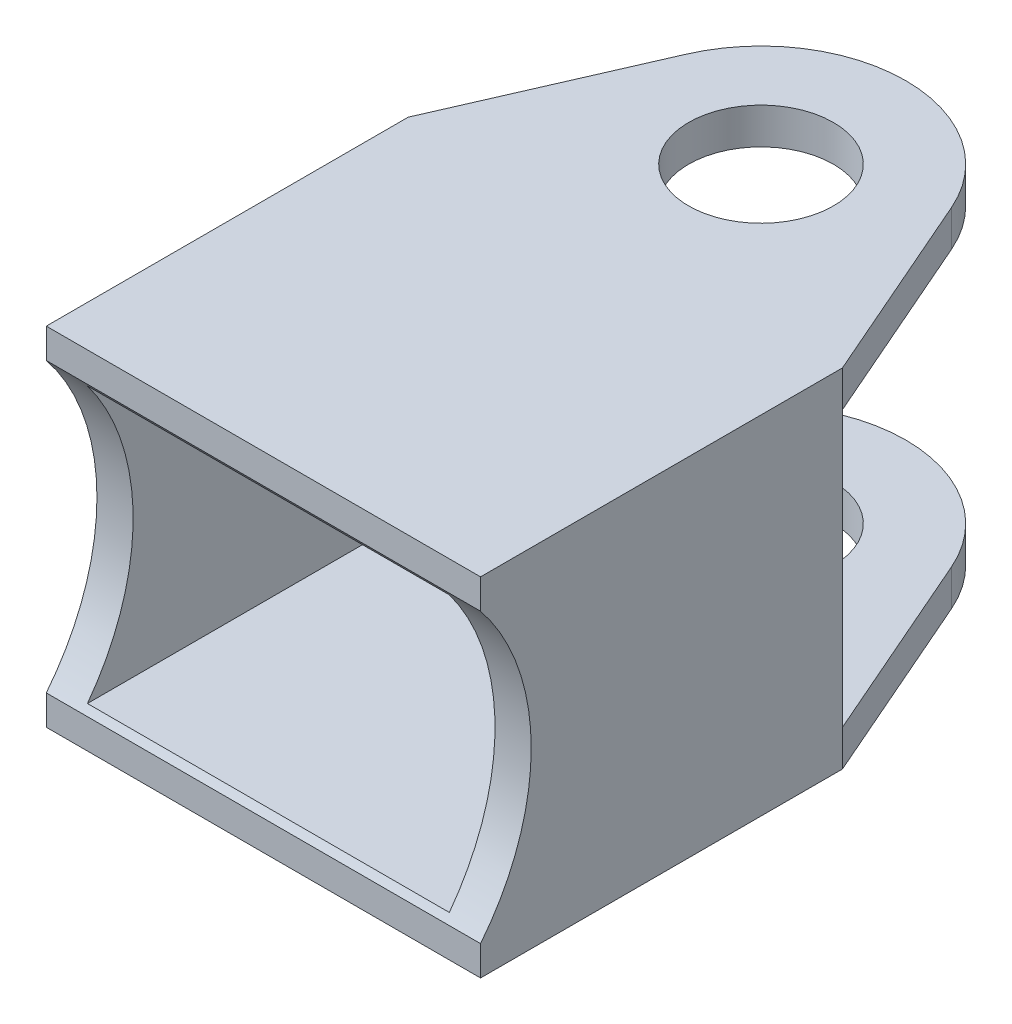
ISO-10303-21;
HEADER;
FILE_DESCRIPTION(('STEP AP214'),'2;1');
FILE_NAME('part.step','',(''),(''),'','','');
FILE_SCHEMA(('AUTOMOTIVE_DESIGN { 1 0 10303 214 1 1 1 1 }'));
ENDSEC;
DATA;
#1=APPLICATION_CONTEXT('core data for automotive mechanical design processes');
#2=APPLICATION_PROTOCOL_DEFINITION('international standard','automotive_design',2000,#1);
#3=PRODUCT_CONTEXT('',#1,'mechanical');
#4=PRODUCT('Part','Part','',(#3));
#5=PRODUCT_RELATED_PRODUCT_CATEGORY('part','',(#4));
#6=PRODUCT_DEFINITION_FORMATION('','',#4);
#7=PRODUCT_DEFINITION_CONTEXT('part definition',#1,'design');
#8=PRODUCT_DEFINITION('design','',#6,#7);
#9=PRODUCT_DEFINITION_SHAPE('','',#8);
#10=(LENGTH_UNIT() NAMED_UNIT(*) SI_UNIT(.MILLI.,.METRE.));
#11=(NAMED_UNIT(*) PLANE_ANGLE_UNIT() SI_UNIT($,.RADIAN.));
#12=(NAMED_UNIT(*) SI_UNIT($,.STERADIAN.) SOLID_ANGLE_UNIT());
#13=UNCERTAINTY_MEASURE_WITH_UNIT(LENGTH_MEASURE(1.E-05),#10,'distance_accuracy_value','');
#14=(GEOMETRIC_REPRESENTATION_CONTEXT(3) GLOBAL_UNCERTAINTY_ASSIGNED_CONTEXT((#13)) GLOBAL_UNIT_ASSIGNED_CONTEXT((#10,
#11,#12)) REPRESENTATION_CONTEXT('',''));
#15=CARTESIAN_POINT('',(0.,0.,0.));
#16=DIRECTION('',(0.,0.,1.));
#17=DIRECTION('',(1.,0.,0.));
#18=AXIS2_PLACEMENT_3D('',#15,#16,#17);
#19=CARTESIAN_POINT('',(0.,7.6,0.));
#20=DIRECTION('',(0.,-1.,0.));
#21=DIRECTION('',(0.,0.,1.));
#22=AXIS2_PLACEMENT_3D('',#19,#20,#21);
#23=PLANE('',#22);
#24=CARTESIAN_POINT('',(0.,7.6,0.));
#25=DIRECTION('',(0.,-1.,0.));
#26=DIRECTION('',(0.,0.,-1.));
#27=AXIS2_PLACEMENT_3D('',#24,#25,#26);
#28=CIRCLE('',#27,4.);
#29=CARTESIAN_POINT('',(0.,7.6,-4.));
#30=VERTEX_POINT('',#29);
#31=EDGE_CURVE('E287',#30,#30,#28,.T.);
#32=ORIENTED_EDGE('',*,*,#31,.F.);
#33=EDGE_LOOP('',(#32));
#34=FACE_BOUND('',#33,.T.);
#35=DIRECTION('',(0.,0.,-1.));
#36=VECTOR('',#35,1.);
#37=CARTESIAN_POINT('',(-10.,7.6,27.5));
#38=LINE('',#37,#36);
#39=CARTESIAN_POINT('',(-10.,7.6,27.2250307125771));
#40=VERTEX_POINT('',#39);
#41=CARTESIAN_POINT('',(-10.,7.6,7.5));
#42=VERTEX_POINT('',#41);
#43=EDGE_CURVE('E41',#40,#42,#38,.T.);
#44=ORIENTED_EDGE('',*,*,#43,.T.);
#45=DIRECTION('',(-1.,0.,0.));
#46=VECTOR('',#45,1.);
#47=CARTESIAN_POINT('',(-12.,7.6,7.5));
#48=LINE('',#47,#46);
#49=CARTESIAN_POINT('',(-12.,7.6,7.5));
#50=VERTEX_POINT('',#49);
#51=EDGE_CURVE('E245',#42,#50,#48,.T.);
#52=ORIENTED_EDGE('',*,*,#51,.T.);
#53=DIRECTION('',(0.399857230257903,0.,-0.916577435577856));
#54=VECTOR('',#53,1.);
#55=CARTESIAN_POINT('',(-12.,7.6,7.5));
#56=LINE('',#55,#54);
#57=CARTESIAN_POINT('',(-7.33261948462285,7.6,-3.19885784206322));
#58=VERTEX_POINT('',#57);
#59=EDGE_CURVE('E270',#50,#58,#56,.T.);
#60=ORIENTED_EDGE('',*,*,#59,.T.);
#61=CARTESIAN_POINT('',(0.,7.6,0.));
#62=DIRECTION('',(0.,-1.,0.));
#63=DIRECTION('',(0.,0.,1.));
#64=AXIS2_PLACEMENT_3D('',#61,#62,#63);
#65=CIRCLE('',#64,8.);
#66=CARTESIAN_POINT('',(7.33261948462285,7.6,-3.19885784206322));
#67=VERTEX_POINT('',#66);
#68=EDGE_CURVE('E267',#58,#67,#65,.T.);
#69=ORIENTED_EDGE('',*,*,#68,.T.);
#70=DIRECTION('',(0.399857230257902,0.,0.916577435577856));
#71=VECTOR('',#70,1.);
#72=CARTESIAN_POINT('',(12.,7.6,7.5));
#73=LINE('',#72,#71);
#74=CARTESIAN_POINT('',(12.,7.6,7.5));
#75=VERTEX_POINT('',#74);
#76=EDGE_CURVE('E264',#67,#75,#73,.T.);
#77=ORIENTED_EDGE('',*,*,#76,.T.);
#78=DIRECTION('',(-1.,0.,0.));
#79=VECTOR('',#78,1.);
#80=CARTESIAN_POINT('',(12.,7.6,7.5));
#81=LINE('',#80,#79);
#82=CARTESIAN_POINT('',(10.,7.6,7.5));
#83=VERTEX_POINT('',#82);
#84=EDGE_CURVE('E195',#75,#83,#81,.T.);
#85=ORIENTED_EDGE('',*,*,#84,.T.);
#86=DIRECTION('',(0.,0.,1.));
#87=VECTOR('',#86,1.);
#88=CARTESIAN_POINT('',(10.,7.6,27.5));
#89=LINE('',#88,#87);
#90=CARTESIAN_POINT('',(10.,7.6,27.2250307125771));
#91=VERTEX_POINT('',#90);
#92=EDGE_CURVE('E191',#83,#91,#89,.T.);
#93=ORIENTED_EDGE('',*,*,#92,.T.);
#94=DIRECTION('',(-1.,0.,0.));
#95=VECTOR('',#94,1.);
#96=CARTESIAN_POINT('',(12.,7.6,27.2250307125771));
#97=LINE('',#96,#95);
#98=EDGE_CURVE('E177',#40,#91,#97,.F.);
#99=ORIENTED_EDGE('',*,*,#98,.F.);
#100=EDGE_LOOP('',(#44,#52,#60,#69,#77,#85,#93,#99));
#101=FACE_BOUND('',#100,.T.);
#102=ADVANCED_FACE('F37',(#34,#101),#23,.T.);
#103=CARTESIAN_POINT('',(0.,-7.6,0.));
#104=DIRECTION('',(0.,-1.,0.));
#105=DIRECTION('',(0.,0.,1.));
#106=AXIS2_PLACEMENT_3D('',#103,#104,#105);
#107=PLANE('',#106);
#108=CARTESIAN_POINT('',(0.,-7.6,0.));
#109=DIRECTION('',(0.,-1.,0.));
#110=DIRECTION('',(0.,0.,-1.));
#111=AXIS2_PLACEMENT_3D('',#108,#109,#110);
#112=CIRCLE('',#111,4.);
#113=CARTESIAN_POINT('',(0.,-7.6,-4.));
#114=VERTEX_POINT('',#113);
#115=EDGE_CURVE('E194',#114,#114,#112,.T.);
#116=ORIENTED_EDGE('',*,*,#115,.T.);
#117=EDGE_LOOP('',(#116));
#118=FACE_BOUND('',#117,.T.);
#119=DIRECTION('',(-1.,0.,0.));
#120=VECTOR('',#119,1.);
#121=CARTESIAN_POINT('',(12.,-7.6,27.2250307125771));
#122=LINE('',#121,#120);
#123=CARTESIAN_POINT('',(-10.,-7.6,27.2250307125771));
#124=VERTEX_POINT('',#123);
#125=CARTESIAN_POINT('',(10.,-7.6,27.2250307125771));
#126=VERTEX_POINT('',#125);
#127=EDGE_CURVE('E174',#124,#126,#122,.F.);
#128=ORIENTED_EDGE('',*,*,#127,.T.);
#129=DIRECTION('',(0.,0.,-1.));
#130=VECTOR('',#129,1.);
#131=CARTESIAN_POINT('',(10.,-7.6,27.5));
#132=LINE('',#131,#130);
#133=CARTESIAN_POINT('',(10.,-7.6,7.5));
#134=VERTEX_POINT('',#133);
#135=EDGE_CURVE('E159',#126,#134,#132,.T.);
#136=ORIENTED_EDGE('',*,*,#135,.T.);
#137=DIRECTION('',(1.,0.,0.));
#138=VECTOR('',#137,1.);
#139=CARTESIAN_POINT('',(12.,-7.6,7.5));
#140=LINE('',#139,#138);
#141=CARTESIAN_POINT('',(12.,-7.6,7.5));
#142=VERTEX_POINT('',#141);
#143=EDGE_CURVE('E185',#134,#142,#140,.T.);
#144=ORIENTED_EDGE('',*,*,#143,.T.);
#145=DIRECTION('',(0.399857230257902,0.,0.916577435577856));
#146=VECTOR('',#145,1.);
#147=CARTESIAN_POINT('',(12.,-7.6,7.5));
#148=LINE('',#147,#146);
#149=CARTESIAN_POINT('',(7.33261948462285,-7.6,-3.19885784206322));
#150=VERTEX_POINT('',#149);
#151=EDGE_CURVE('E211',#150,#142,#148,.T.);
#152=ORIENTED_EDGE('',*,*,#151,.F.);
#153=CARTESIAN_POINT('',(0.,-7.6,0.));
#154=DIRECTION('',(0.,-1.,0.));
#155=DIRECTION('',(0.,0.,1.));
#156=AXIS2_PLACEMENT_3D('',#153,#154,#155);
#157=CIRCLE('',#156,8.);
#158=CARTESIAN_POINT('',(-7.33261948462285,-7.6,-3.19885784206322));
#159=VERTEX_POINT('',#158);
#160=EDGE_CURVE('E226',#159,#150,#157,.T.);
#161=ORIENTED_EDGE('',*,*,#160,.F.);
#162=DIRECTION('',(0.399857230257903,0.,-0.916577435577856));
#163=VECTOR('',#162,1.);
#164=CARTESIAN_POINT('',(-12.,-7.6,7.5));
#165=LINE('',#164,#163);
#166=CARTESIAN_POINT('',(-12.,-7.6,7.5));
#167=VERTEX_POINT('',#166);
#168=EDGE_CURVE('E204',#167,#159,#165,.T.);
#169=ORIENTED_EDGE('',*,*,#168,.F.);
#170=DIRECTION('',(1.,0.,0.));
#171=VECTOR('',#170,1.);
#172=CARTESIAN_POINT('',(-12.,-7.6,7.5));
#173=LINE('',#172,#171);
#174=CARTESIAN_POINT('',(-10.,-7.6,7.5));
#175=VERTEX_POINT('',#174);
#176=EDGE_CURVE('E234',#167,#175,#173,.T.);
#177=ORIENTED_EDGE('',*,*,#176,.T.);
#178=DIRECTION('',(0.,0.,1.));
#179=VECTOR('',#178,1.);
#180=CARTESIAN_POINT('',(-10.,-7.6,27.5));
#181=LINE('',#180,#179);
#182=EDGE_CURVE('E242',#175,#124,#181,.T.);
#183=ORIENTED_EDGE('',*,*,#182,.T.);
#184=EDGE_LOOP('',(#128,#136,#144,#152,#161,#169,#177,#183));
#185=FACE_BOUND('',#184,.T.);
#186=ADVANCED_FACE('F306',(#118,#185),#107,.F.);
#187=CARTESIAN_POINT('',(12.,9.6,27.5));
#188=DIRECTION('',(-1.,0.,0.));
#189=DIRECTION('',(0.,0.,-1.));
#190=AXIS2_PLACEMENT_3D('',#187,#188,#189);
#191=PLANE('',#190);
#192=CARTESIAN_POINT('',(12.,0.,37.4));
#193=DIRECTION('',(-1.,0.,0.));
#194=DIRECTION('',(0.,0.,1.));
#195=AXIS2_PLACEMENT_3D('',#192,#193,#194);
#196=CIRCLE('',#195,12.7);
#197=CARTESIAN_POINT('',(12.,7.95487272054054,27.5));
#198=VERTEX_POINT('',#197);
#199=CARTESIAN_POINT('',(12.,-7.95487272054054,27.5));
#200=VERTEX_POINT('',#199);
#201=EDGE_CURVE('E165',#198,#200,#196,.T.);
#202=ORIENTED_EDGE('',*,*,#201,.T.);
#203=DIRECTION('',(0.,-1.,0.));
#204=VECTOR('',#203,1.);
#205=CARTESIAN_POINT('',(12.,9.6,27.5));
#206=LINE('',#205,#204);
#207=CARTESIAN_POINT('',(12.,-9.6,27.5));
#208=VERTEX_POINT('',#207);
#209=EDGE_CURVE('E169',#200,#208,#206,.T.);
#210=ORIENTED_EDGE('',*,*,#209,.T.);
#211=DIRECTION('',(0.,0.,1.));
#212=VECTOR('',#211,1.);
#213=CARTESIAN_POINT('',(12.,-9.6,27.5));
#214=LINE('',#213,#212);
#215=CARTESIAN_POINT('',(12.,-9.6,7.5));
#216=VERTEX_POINT('',#215);
#217=EDGE_CURVE('E207',#216,#208,#214,.T.);
#218=ORIENTED_EDGE('',*,*,#217,.F.);
#219=DIRECTION('',(0.,1.,0.));
#220=VECTOR('',#219,1.);
#221=CARTESIAN_POINT('',(12.,-9.6,7.5));
#222=LINE('',#221,#220);
#223=EDGE_CURVE('E231',#216,#142,#222,.T.);
#224=ORIENTED_EDGE('',*,*,#223,.T.);
#225=DIRECTION('',(0.,-1.,0.));
#226=VECTOR('',#225,1.);
#227=CARTESIAN_POINT('',(12.,27.6997512422418,7.5));
#228=LINE('',#227,#226);
#229=EDGE_CURVE('E188',#75,#142,#228,.T.);
#230=ORIENTED_EDGE('',*,*,#229,.F.);
#231=DIRECTION('',(0.,-1.,0.));
#232=VECTOR('',#231,1.);
#233=CARTESIAN_POINT('',(12.,9.6,7.5));
#234=LINE('',#233,#232);
#235=CARTESIAN_POINT('',(12.,9.6,7.5));
#236=VERTEX_POINT('',#235);
#237=EDGE_CURVE('E261',#236,#75,#234,.T.);
#238=ORIENTED_EDGE('',*,*,#237,.F.);
#239=DIRECTION('',(0.,0.,1.));
#240=VECTOR('',#239,1.);
#241=CARTESIAN_POINT('',(12.,9.6,27.5));
#242=LINE('',#241,#240);
#243=CARTESIAN_POINT('',(12.,9.6,27.5));
#244=VERTEX_POINT('',#243);
#245=EDGE_CURVE('E168',#236,#244,#242,.T.);
#246=ORIENTED_EDGE('',*,*,#245,.T.);
#247=EDGE_CURVE('E47',#244,#198,#206,.T.);
#248=ORIENTED_EDGE('',*,*,#247,.T.);
#249=EDGE_LOOP('',(#202,#210,#218,#224,#230,#238,#246,#248));
#250=FACE_BOUND('',#249,.T.);
#251=ADVANCED_FACE('F39',(#250),#191,.F.);
#252=CARTESIAN_POINT('',(7.06,9.6,27.5));
#253=DIRECTION('',(0.,0.,-1.));
#254=DIRECTION('',(1.,0.,0.));
#255=AXIS2_PLACEMENT_3D('',#252,#253,#254);
#256=PLANE('',#255);
#257=DIRECTION('',(-1.,0.,0.));
#258=VECTOR('',#257,1.);
#259=CARTESIAN_POINT('',(12.,7.95487272054054,27.5));
#260=LINE('',#259,#258);
#261=CARTESIAN_POINT('',(-12.,7.95487272054054,27.5));
#262=VERTEX_POINT('',#261);
#263=EDGE_CURVE('E151',#262,#198,#260,.F.);
#264=ORIENTED_EDGE('',*,*,#263,.T.);
#265=ORIENTED_EDGE('',*,*,#247,.F.);
#266=DIRECTION('',(-1.,0.,0.));
#267=VECTOR('',#266,1.);
#268=CARTESIAN_POINT('',(7.06,9.6,27.5));
#269=LINE('',#268,#267);
#270=CARTESIAN_POINT('',(-12.,9.6,27.5));
#271=VERTEX_POINT('',#270);
#272=EDGE_CURVE('E284',#244,#271,#269,.T.);
#273=ORIENTED_EDGE('',*,*,#272,.T.);
#274=DIRECTION('',(0.,-1.,0.));
#275=VECTOR('',#274,1.);
#276=CARTESIAN_POINT('',(-12.,9.6,27.5));
#277=LINE('',#276,#275);
#278=EDGE_CURVE('E157',#271,#262,#277,.T.);
#279=ORIENTED_EDGE('',*,*,#278,.T.);
#280=EDGE_LOOP('',(#264,#265,#273,#279));
#281=FACE_BOUND('',#280,.T.);
#282=ADVANCED_FACE('F153',(#281),#256,.F.);
#283=DIRECTION('',(-1.,0.,0.));
#284=VECTOR('',#283,1.);
#285=CARTESIAN_POINT('',(12.,-7.95487272054054,27.5));
#286=LINE('',#285,#284);
#287=CARTESIAN_POINT('',(-12.,-7.95487272054054,27.5));
#288=VERTEX_POINT('',#287);
#289=EDGE_CURVE('E160',#200,#288,#286,.T.);
#290=ORIENTED_EDGE('',*,*,#289,.T.);
#291=CARTESIAN_POINT('',(-12.,-9.6,27.5));
#292=VERTEX_POINT('',#291);
#293=EDGE_CURVE('E253',#288,#292,#277,.T.);
#294=ORIENTED_EDGE('',*,*,#293,.T.);
#295=DIRECTION('',(-1.,0.,0.));
#296=VECTOR('',#295,1.);
#297=CARTESIAN_POINT('',(7.06,-9.6,27.5));
#298=LINE('',#297,#296);
#299=EDGE_CURVE('E210',#208,#292,#298,.T.);
#300=ORIENTED_EDGE('',*,*,#299,.F.);
#301=ORIENTED_EDGE('',*,*,#209,.F.);
#302=EDGE_LOOP('',(#290,#294,#300,#301));
#303=FACE_BOUND('',#302,.T.);
#304=ADVANCED_FACE('F343',(#303),#256,.F.);
#305=CARTESIAN_POINT('',(-12.,9.6,22.8889007140539));
#306=DIRECTION('',(1.,0.,0.));
#307=DIRECTION('',(0.,0.,1.));
#308=AXIS2_PLACEMENT_3D('',#305,#306,#307);
#309=PLANE('',#308);
#310=CARTESIAN_POINT('',(-12.,0.,37.4));
#311=DIRECTION('',(-1.,0.,0.));
#312=DIRECTION('',(0.,0.,1.));
#313=AXIS2_PLACEMENT_3D('',#310,#311,#312);
#314=CIRCLE('',#313,12.7);
#315=EDGE_CURVE('E54',#262,#288,#314,.T.);
#316=ORIENTED_EDGE('',*,*,#315,.F.);
#317=ORIENTED_EDGE('',*,*,#278,.F.);
#318=DIRECTION('',(0.,0.,-1.));
#319=VECTOR('',#318,1.);
#320=CARTESIAN_POINT('',(-12.,9.6,27.5));
#321=LINE('',#320,#319);
#322=CARTESIAN_POINT('',(-12.,9.6,7.5));
#323=VERTEX_POINT('',#322);
#324=EDGE_CURVE('E281',#271,#323,#321,.T.);
#325=ORIENTED_EDGE('',*,*,#324,.T.);
#326=DIRECTION('',(0.,-1.,0.));
#327=VECTOR('',#326,1.);
#328=CARTESIAN_POINT('',(-12.,9.6,7.5));
#329=LINE('',#328,#327);
#330=EDGE_CURVE('E254',#323,#50,#329,.T.);
#331=ORIENTED_EDGE('',*,*,#330,.T.);
#332=DIRECTION('',(0.,-1.,0.));
#333=VECTOR('',#332,1.);
#334=CARTESIAN_POINT('',(-12.,27.6997512422418,7.5));
#335=LINE('',#334,#333);
#336=EDGE_CURVE('E292',#50,#167,#335,.T.);
#337=ORIENTED_EDGE('',*,*,#336,.T.);
#338=DIRECTION('',(0.,1.,0.));
#339=VECTOR('',#338,1.);
#340=CARTESIAN_POINT('',(-12.,-9.6,7.5));
#341=LINE('',#340,#339);
#342=CARTESIAN_POINT('',(-12.,-9.6,7.5));
#343=VERTEX_POINT('',#342);
#344=EDGE_CURVE('E223',#343,#167,#341,.T.);
#345=ORIENTED_EDGE('',*,*,#344,.F.);
#346=DIRECTION('',(0.,0.,-1.));
#347=VECTOR('',#346,1.);
#348=CARTESIAN_POINT('',(-12.,-9.6,27.5));
#349=LINE('',#348,#347);
#350=EDGE_CURVE('E214',#292,#343,#349,.T.);
#351=ORIENTED_EDGE('',*,*,#350,.F.);
#352=ORIENTED_EDGE('',*,*,#293,.F.);
#353=EDGE_LOOP('',(#316,#317,#325,#331,#337,#345,#351,#352));
#354=FACE_BOUND('',#353,.T.);
#355=ADVANCED_FACE('F315',(#354),#309,.F.);
#356=CARTESIAN_POINT('',(-10.,27.6997512422418,27.5));
#357=DIRECTION('',(-1.,0.,0.));
#358=DIRECTION('',(0.,0.,-1.));
#359=AXIS2_PLACEMENT_3D('',#356,#357,#358);
#360=PLANE('',#359);
#361=CARTESIAN_POINT('',(-10.,0.,37.4));
#362=DIRECTION('',(1.,0.,0.));
#363=DIRECTION('',(0.,0.,-1.));
#364=AXIS2_PLACEMENT_3D('',#361,#362,#363);
#365=CIRCLE('',#364,12.7);
#366=EDGE_CURVE('E182',#40,#124,#365,.F.);
#367=ORIENTED_EDGE('',*,*,#366,.T.);
#368=ORIENTED_EDGE('',*,*,#182,.F.);
#369=DIRECTION('',(0.,-1.,0.));
#370=VECTOR('',#369,1.);
#371=CARTESIAN_POINT('',(-10.,27.6997512422418,7.5));
#372=LINE('',#371,#370);
#373=EDGE_CURVE('E249',#42,#175,#372,.T.);
#374=ORIENTED_EDGE('',*,*,#373,.F.);
#375=ORIENTED_EDGE('',*,*,#43,.F.);
#376=EDGE_LOOP('',(#367,#368,#374,#375));
#377=FACE_BOUND('',#376,.T.);
#378=ADVANCED_FACE('F304',(#377),#360,.F.);
#379=CARTESIAN_POINT('',(10.,27.6997512422418,27.5));
#380=DIRECTION('',(1.,0.,0.));
#381=DIRECTION('',(0.,0.,1.));
#382=AXIS2_PLACEMENT_3D('',#379,#380,#381);
#383=PLANE('',#382);
#384=CARTESIAN_POINT('',(10.,0.,37.4));
#385=DIRECTION('',(-1.,0.,0.));
#386=DIRECTION('',(0.,0.,1.));
#387=AXIS2_PLACEMENT_3D('',#384,#385,#386);
#388=CIRCLE('',#387,12.7);
#389=EDGE_CURVE('E11',#126,#91,#388,.F.);
#390=ORIENTED_EDGE('',*,*,#389,.T.);
#391=ORIENTED_EDGE('',*,*,#92,.F.);
#392=DIRECTION('',(0.,-1.,0.));
#393=VECTOR('',#392,1.);
#394=CARTESIAN_POINT('',(10.,27.6997512422418,7.5));
#395=LINE('',#394,#393);
#396=EDGE_CURVE('E197',#83,#134,#395,.T.);
#397=ORIENTED_EDGE('',*,*,#396,.T.);
#398=ORIENTED_EDGE('',*,*,#135,.F.);
#399=EDGE_LOOP('',(#390,#391,#397,#398));
#400=FACE_BOUND('',#399,.T.);
#401=ADVANCED_FACE('F326',(#400),#383,.F.);
#402=CARTESIAN_POINT('',(0.,9.6,0.));
#403=DIRECTION('',(0.,-1.,0.));
#404=DIRECTION('',(0.,0.,1.));
#405=AXIS2_PLACEMENT_3D('',#402,#403,#404);
#406=PLANE('',#405);
#407=ORIENTED_EDGE('',*,*,#245,.F.);
#408=DIRECTION('',(0.399857230257902,0.,0.916577435577856));
#409=VECTOR('',#408,1.);
#410=CARTESIAN_POINT('',(12.,9.6,7.5));
#411=LINE('',#410,#409);
#412=CARTESIAN_POINT('',(7.33261948462285,9.6,-3.19885784206322));
#413=VERTEX_POINT('',#412);
#414=EDGE_CURVE('E263',#413,#236,#411,.T.);
#415=ORIENTED_EDGE('',*,*,#414,.F.);
#416=CARTESIAN_POINT('',(0.,9.6,0.));
#417=DIRECTION('',(0.,-1.,0.));
#418=DIRECTION('',(0.,0.,1.));
#419=AXIS2_PLACEMENT_3D('',#416,#417,#418);
#420=CIRCLE('',#419,8.);
#421=CARTESIAN_POINT('',(-7.33261948462285,9.6,-3.19885784206322));
#422=VERTEX_POINT('',#421);
#423=EDGE_CURVE('E275',#422,#413,#420,.T.);
#424=ORIENTED_EDGE('',*,*,#423,.F.);
#425=DIRECTION('',(0.399857230257903,0.,-0.916577435577856));
#426=VECTOR('',#425,1.);
#427=CARTESIAN_POINT('',(-12.,9.6,7.5));
#428=LINE('',#427,#426);
#429=EDGE_CURVE('E278',#323,#422,#428,.T.);
#430=ORIENTED_EDGE('',*,*,#429,.F.);
#431=ORIENTED_EDGE('',*,*,#324,.F.);
#432=ORIENTED_EDGE('',*,*,#272,.F.);
#433=EDGE_LOOP('',(#407,#415,#424,#430,#431,#432));
#434=FACE_BOUND('',#433,.T.);
#435=CARTESIAN_POINT('',(0.,9.6,0.));
#436=DIRECTION('',(0.,-1.,0.));
#437=DIRECTION('',(0.,0.,-1.));
#438=AXIS2_PLACEMENT_3D('',#435,#436,#437);
#439=CIRCLE('',#438,4.);
#440=CARTESIAN_POINT('',(0.,9.6,-4.));
#441=VERTEX_POINT('',#440);
#442=EDGE_CURVE('E273',#441,#441,#439,.T.);
#443=ORIENTED_EDGE('',*,*,#442,.T.);
#444=EDGE_LOOP('',(#443));
#445=FACE_BOUND('',#444,.T.);
#446=ADVANCED_FACE('F361',(#434,#445),#406,.F.);
#447=CARTESIAN_POINT('',(-12.,9.6,7.5));
#448=DIRECTION('',(0.916577435577856,0.,0.399857230257903));
#449=DIRECTION('',(-0.399857230257903,0.,0.916577435577856));
#450=AXIS2_PLACEMENT_3D('',#447,#448,#449);
#451=PLANE('',#450);
#452=ORIENTED_EDGE('',*,*,#59,.F.);
#453=ORIENTED_EDGE('',*,*,#330,.F.);
#454=ORIENTED_EDGE('',*,*,#429,.T.);
#455=DIRECTION('',(0.,-1.,0.));
#456=VECTOR('',#455,1.);
#457=CARTESIAN_POINT('',(-7.33261948462285,9.6,-3.19885784206322));
#458=LINE('',#457,#456);
#459=EDGE_CURVE('E257',#422,#58,#458,.T.);
#460=ORIENTED_EDGE('',*,*,#459,.T.);
#461=EDGE_LOOP('',(#452,#453,#454,#460));
#462=FACE_BOUND('',#461,.T.);
#463=ADVANCED_FACE('F319',(#462),#451,.F.);
#464=CARTESIAN_POINT('',(0.,9.6,0.));
#465=DIRECTION('',(0.,-1.,0.));
#466=DIRECTION('',(0.,0.,1.));
#467=AXIS2_PLACEMENT_3D('',#464,#465,#466);
#468=CYLINDRICAL_SURFACE('',#467,8.);
#469=ORIENTED_EDGE('',*,*,#68,.F.);
#470=ORIENTED_EDGE('',*,*,#459,.F.);
#471=ORIENTED_EDGE('',*,*,#423,.T.);
#472=DIRECTION('',(0.,-1.,0.));
#473=VECTOR('',#472,1.);
#474=CARTESIAN_POINT('',(7.33261948462285,9.6,-3.19885784206322));
#475=LINE('',#474,#473);
#476=EDGE_CURVE('E259',#413,#67,#475,.T.);
#477=ORIENTED_EDGE('',*,*,#476,.T.);
#478=EDGE_LOOP('',(#469,#470,#471,#477));
#479=FACE_BOUND('',#478,.T.);
#480=ADVANCED_FACE('F367',(#479),#468,.T.);
#481=CARTESIAN_POINT('',(12.,9.6,7.5));
#482=DIRECTION('',(-0.916577435577856,0.,0.399857230257902));
#483=DIRECTION('',(-0.399857230257902,0.,-0.916577435577856));
#484=AXIS2_PLACEMENT_3D('',#481,#482,#483);
#485=PLANE('',#484);
#486=ORIENTED_EDGE('',*,*,#76,.F.);
#487=ORIENTED_EDGE('',*,*,#476,.F.);
#488=ORIENTED_EDGE('',*,*,#414,.T.);
#489=ORIENTED_EDGE('',*,*,#237,.T.);
#490=EDGE_LOOP('',(#486,#487,#488,#489));
#491=FACE_BOUND('',#490,.T.);
#492=ADVANCED_FACE('F363',(#491),#485,.F.);
#493=CARTESIAN_POINT('',(0.,9.6,0.));
#494=DIRECTION('',(0.,-1.,0.));
#495=DIRECTION('',(0.,0.,1.));
#496=AXIS2_PLACEMENT_3D('',#493,#494,#495);
#497=CYLINDRICAL_SURFACE('',#496,4.);
#498=ORIENTED_EDGE('',*,*,#442,.F.);
#499=EDGE_LOOP('',(#498));
#500=FACE_BOUND('',#499,.T.);
#501=ORIENTED_EDGE('',*,*,#31,.T.);
#502=EDGE_LOOP('',(#501));
#503=FACE_BOUND('',#502,.T.);
#504=ADVANCED_FACE('F366',(#500,#503),#497,.F.);
#505=CARTESIAN_POINT('',(-12.,27.6997512422418,7.5));
#506=DIRECTION('',(0.,0.,1.));
#507=DIRECTION('',(-1.,0.,0.));
#508=AXIS2_PLACEMENT_3D('',#505,#506,#507);
#509=PLANE('',#508);
#510=ORIENTED_EDGE('',*,*,#373,.T.);
#511=ORIENTED_EDGE('',*,*,#176,.F.);
#512=ORIENTED_EDGE('',*,*,#336,.F.);
#513=ORIENTED_EDGE('',*,*,#51,.F.);
#514=EDGE_LOOP('',(#510,#511,#512,#513));
#515=FACE_BOUND('',#514,.T.);
#516=ADVANCED_FACE('F298',(#515),#509,.F.);
#517=CARTESIAN_POINT('',(12.,-9.6,7.5));
#518=DIRECTION('',(0.916577435577856,0.,-0.399857230257902));
#519=DIRECTION('',(0.399857230257902,0.,0.916577435577856));
#520=AXIS2_PLACEMENT_3D('',#517,#518,#519);
#521=PLANE('',#520);
#522=ORIENTED_EDGE('',*,*,#151,.T.);
#523=ORIENTED_EDGE('',*,*,#223,.F.);
#524=DIRECTION('',(0.399857230257902,0.,0.916577435577856));
#525=VECTOR('',#524,1.);
#526=CARTESIAN_POINT('',(12.,-9.6,7.5));
#527=LINE('',#526,#525);
#528=CARTESIAN_POINT('',(7.33261948462285,-9.6,-3.19885784206322));
#529=VERTEX_POINT('',#528);
#530=EDGE_CURVE('E221',#529,#216,#527,.T.);
#531=ORIENTED_EDGE('',*,*,#530,.F.);
#532=DIRECTION('',(0.,1.,0.));
#533=VECTOR('',#532,1.);
#534=CARTESIAN_POINT('',(7.33261948462285,-9.6,-3.19885784206322));
#535=LINE('',#534,#533);
#536=EDGE_CURVE('E235',#529,#150,#535,.T.);
#537=ORIENTED_EDGE('',*,*,#536,.T.);
#538=EDGE_LOOP('',(#522,#523,#531,#537));
#539=FACE_BOUND('',#538,.T.);
#540=ADVANCED_FACE('F335',(#539),#521,.T.);
#541=CARTESIAN_POINT('',(0.,-9.6,0.));
#542=DIRECTION('',(0.,1.,0.));
#543=DIRECTION('',(0.,0.,-1.));
#544=AXIS2_PLACEMENT_3D('',#541,#542,#543);
#545=CYLINDRICAL_SURFACE('',#544,8.);
#546=ORIENTED_EDGE('',*,*,#160,.T.);
#547=ORIENTED_EDGE('',*,*,#536,.F.);
#548=CARTESIAN_POINT('',(0.,-9.6,0.));
#549=DIRECTION('',(0.,-1.,0.));
#550=DIRECTION('',(0.,0.,1.));
#551=AXIS2_PLACEMENT_3D('',#548,#549,#550);
#552=CIRCLE('',#551,8.);
#553=CARTESIAN_POINT('',(-7.33261948462285,-9.6,-3.19885784206322));
#554=VERTEX_POINT('',#553);
#555=EDGE_CURVE('E219',#554,#529,#552,.T.);
#556=ORIENTED_EDGE('',*,*,#555,.F.);
#557=DIRECTION('',(0.,1.,0.));
#558=VECTOR('',#557,1.);
#559=CARTESIAN_POINT('',(-7.33261948462285,-9.6,-3.19885784206322));
#560=LINE('',#559,#558);
#561=EDGE_CURVE('E237',#554,#159,#560,.T.);
#562=ORIENTED_EDGE('',*,*,#561,.T.);
#563=EDGE_LOOP('',(#546,#547,#556,#562));
#564=FACE_BOUND('',#563,.T.);
#565=ADVANCED_FACE('F338',(#564),#545,.T.);
#566=CARTESIAN_POINT('',(-12.,-9.6,7.5));
#567=DIRECTION('',(-0.916577435577856,0.,-0.399857230257903));
#568=DIRECTION('',(0.399857230257903,0.,-0.916577435577856));
#569=AXIS2_PLACEMENT_3D('',#566,#567,#568);
#570=PLANE('',#569);
#571=ORIENTED_EDGE('',*,*,#168,.T.);
#572=ORIENTED_EDGE('',*,*,#561,.F.);
#573=DIRECTION('',(0.399857230257903,0.,-0.916577435577856));
#574=VECTOR('',#573,1.);
#575=CARTESIAN_POINT('',(-12.,-9.6,7.5));
#576=LINE('',#575,#574);
#577=EDGE_CURVE('E217',#343,#554,#576,.T.);
#578=ORIENTED_EDGE('',*,*,#577,.F.);
#579=ORIENTED_EDGE('',*,*,#344,.T.);
#580=EDGE_LOOP('',(#571,#572,#578,#579));
#581=FACE_BOUND('',#580,.T.);
#582=ADVANCED_FACE('F311',(#581),#570,.T.);
#583=CARTESIAN_POINT('',(0.,-9.6,0.));
#584=DIRECTION('',(0.,-1.,0.));
#585=DIRECTION('',(0.,0.,1.));
#586=AXIS2_PLACEMENT_3D('',#583,#584,#585);
#587=PLANE('',#586);
#588=CARTESIAN_POINT('',(0.,-9.6,0.));
#589=DIRECTION('',(0.,-1.,0.));
#590=DIRECTION('',(0.,0.,-1.));
#591=AXIS2_PLACEMENT_3D('',#588,#589,#590);
#592=CIRCLE('',#591,4.);
#593=CARTESIAN_POINT('',(0.,-9.6,-4.));
#594=VERTEX_POINT('',#593);
#595=EDGE_CURVE('E201',#594,#594,#592,.T.);
#596=ORIENTED_EDGE('',*,*,#595,.F.);
#597=EDGE_LOOP('',(#596));
#598=FACE_BOUND('',#597,.T.);
#599=ORIENTED_EDGE('',*,*,#217,.T.);
#600=ORIENTED_EDGE('',*,*,#299,.T.);
#601=ORIENTED_EDGE('',*,*,#350,.T.);
#602=ORIENTED_EDGE('',*,*,#577,.T.);
#603=ORIENTED_EDGE('',*,*,#555,.T.);
#604=ORIENTED_EDGE('',*,*,#530,.T.);
#605=EDGE_LOOP('',(#599,#600,#601,#602,#603,#604));
#606=FACE_BOUND('',#605,.T.);
#607=ADVANCED_FACE('F340',(#598,#606),#587,.T.);
#608=CARTESIAN_POINT('',(0.,-9.6,0.));
#609=DIRECTION('',(0.,1.,0.));
#610=DIRECTION('',(0.,0.,-1.));
#611=AXIS2_PLACEMENT_3D('',#608,#609,#610);
#612=CYLINDRICAL_SURFACE('',#611,4.);
#613=ORIENTED_EDGE('',*,*,#595,.T.);
#614=EDGE_LOOP('',(#613));
#615=FACE_BOUND('',#614,.T.);
#616=ORIENTED_EDGE('',*,*,#115,.F.);
#617=EDGE_LOOP('',(#616));
#618=FACE_BOUND('',#617,.T.);
#619=ADVANCED_FACE('F402',(#615,#618),#612,.F.);
#620=CARTESIAN_POINT('',(12.,27.6997512422418,7.5));
#621=DIRECTION('',(0.,0.,1.));
#622=DIRECTION('',(-1.,0.,0.));
#623=AXIS2_PLACEMENT_3D('',#620,#621,#622);
#624=PLANE('',#623);
#625=ORIENTED_EDGE('',*,*,#229,.T.);
#626=ORIENTED_EDGE('',*,*,#143,.F.);
#627=ORIENTED_EDGE('',*,*,#396,.F.);
#628=ORIENTED_EDGE('',*,*,#84,.F.);
#629=EDGE_LOOP('',(#625,#626,#627,#628));
#630=FACE_BOUND('',#629,.T.);
#631=ADVANCED_FACE('F329',(#630),#624,.F.);
#632=CARTESIAN_POINT('',(12.,0.,37.4));
#633=DIRECTION('',(-1.,0.,0.));
#634=DIRECTION('',(0.,0.,-1.));
#635=AXIS2_PLACEMENT_3D('',#632,#633,#634);
#636=CYLINDRICAL_SURFACE('',#635,12.7);
#637=ORIENTED_EDGE('',*,*,#366,.F.);
#638=ORIENTED_EDGE('',*,*,#98,.T.);
#639=ORIENTED_EDGE('',*,*,#389,.F.);
#640=ORIENTED_EDGE('',*,*,#127,.F.);
#641=EDGE_LOOP('',(#637,#638,#639,#640));
#642=FACE_BOUND('',#641,.T.);
#643=ORIENTED_EDGE('',*,*,#263,.F.);
#644=ORIENTED_EDGE('',*,*,#315,.T.);
#645=ORIENTED_EDGE('',*,*,#289,.F.);
#646=ORIENTED_EDGE('',*,*,#201,.F.);
#647=EDGE_LOOP('',(#643,#644,#645,#646));
#648=FACE_BOUND('',#647,.T.);
#649=ADVANCED_FACE('F171',(#642,#648),#636,.F.);
#650=CLOSED_SHELL('',(#102,#186,#251,#282,#304,#355,#378,#401,#446,#463,#480,#492,#504,#516,
#540,#565,#582,#607,#619,#631,#649));
#651=MANIFOLD_SOLID_BREP('B2',#650);
#652=ADVANCED_BREP_SHAPE_REPRESENTATION('',(#18,#651),#14);
#653=SHAPE_DEFINITION_REPRESENTATION(#9,#652);
ENDSEC;
END-ISO-10303-21;
